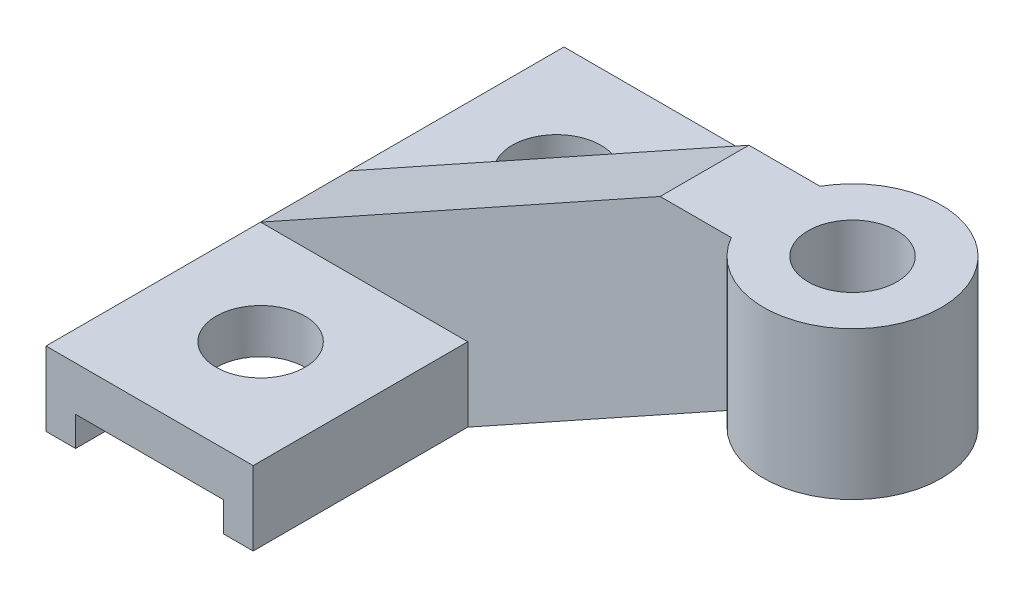
ISO-10303-21;
HEADER;
FILE_DESCRIPTION(('STEP AP214'),'2;1');
FILE_NAME('part.step','',(''),(''),'','','');
FILE_SCHEMA(('AUTOMOTIVE_DESIGN { 1 0 10303 214 1 1 1 1 }'));
ENDSEC;
DATA;
#1=APPLICATION_CONTEXT('core data for automotive mechanical design processes');
#2=APPLICATION_PROTOCOL_DEFINITION('international standard','automotive_design',2000,#1);
#3=PRODUCT_CONTEXT('',#1,'mechanical');
#4=PRODUCT('Part','Part','',(#3));
#5=PRODUCT_RELATED_PRODUCT_CATEGORY('part','',(#4));
#6=PRODUCT_DEFINITION_FORMATION('','',#4);
#7=PRODUCT_DEFINITION_CONTEXT('part definition',#1,'design');
#8=PRODUCT_DEFINITION('design','',#6,#7);
#9=PRODUCT_DEFINITION_SHAPE('','',#8);
#10=(LENGTH_UNIT() NAMED_UNIT(*) SI_UNIT(.MILLI.,.METRE.));
#11=(NAMED_UNIT(*) PLANE_ANGLE_UNIT() SI_UNIT($,.RADIAN.));
#12=(NAMED_UNIT(*) SI_UNIT($,.STERADIAN.) SOLID_ANGLE_UNIT());
#13=UNCERTAINTY_MEASURE_WITH_UNIT(LENGTH_MEASURE(1.E-05),#10,'distance_accuracy_value','');
#14=(GEOMETRIC_REPRESENTATION_CONTEXT(3) GLOBAL_UNCERTAINTY_ASSIGNED_CONTEXT((#13)) GLOBAL_UNIT_ASSIGNED_CONTEXT((#10,
#11,#12)) REPRESENTATION_CONTEXT('',''));
#15=CARTESIAN_POINT('',(0.,0.,0.));
#16=DIRECTION('',(0.,0.,1.));
#17=DIRECTION('',(1.,0.,0.));
#18=AXIS2_PLACEMENT_3D('',#15,#16,#17);
#19=CARTESIAN_POINT('',(0.,0.,3.));
#20=DIRECTION('',(0.,0.,-1.));
#21=DIRECTION('',(-1.,0.,0.));
#22=AXIS2_PLACEMENT_3D('',#19,#20,#21);
#23=PLANE('',#22);
#24=DIRECTION('',(1.,0.,0.));
#25=VECTOR('',#24,1.);
#26=CARTESIAN_POINT('',(0.,5.,3.));
#27=LINE('',#26,#25);
#28=CARTESIAN_POINT('',(24.8038475772934,5.,3.));
#29=VERTEX_POINT('',#28);
#30=CARTESIAN_POINT('',(25.,5.,3.));
#31=VERTEX_POINT('',#30);
#32=EDGE_CURVE('E282',#29,#31,#27,.T.);
#33=ORIENTED_EDGE('',*,*,#32,.F.);
#34=DIRECTION('',(0.,-1.,0.));
#35=VECTOR('',#34,1.);
#36=CARTESIAN_POINT('',(24.8038475772934,15.,3.));
#37=LINE('',#36,#35);
#38=CARTESIAN_POINT('',(24.8038475772934,15.,3.));
#39=VERTEX_POINT('',#38);
#40=EDGE_CURVE('E156',#39,#29,#37,.T.);
#41=ORIENTED_EDGE('',*,*,#40,.F.);
#42=DIRECTION('',(-1.,0.,0.));
#43=VECTOR('',#42,1.);
#44=CARTESIAN_POINT('',(20.,15.,3.));
#45=LINE('',#44,#43);
#46=CARTESIAN_POINT('',(20.,15.,3.));
#47=VERTEX_POINT('',#46);
#48=EDGE_CURVE('E155',#39,#47,#45,.T.);
#49=ORIENTED_EDGE('',*,*,#48,.T.);
#50=DIRECTION('',(-0.874157276121538,-0.485642931178632,0.));
#51=VECTOR('',#50,1.);
#52=CARTESIAN_POINT('',(-7.,0.,3.));
#53=LINE('',#52,#51);
#54=CARTESIAN_POINT('',(-7.,0.,3.));
#55=VERTEX_POINT('',#54);
#56=EDGE_CURVE('E173',#47,#55,#53,.T.);
#57=ORIENTED_EDGE('',*,*,#56,.T.);
#58=DIRECTION('',(1.,0.,0.));
#59=VECTOR('',#58,1.);
#60=CARTESIAN_POINT('',(-7.,0.,3.));
#61=LINE('',#60,#59);
#62=CARTESIAN_POINT('',(7.,0.,3.));
#63=VERTEX_POINT('',#62);
#64=EDGE_CURVE('E163',#55,#63,#61,.T.);
#65=ORIENTED_EDGE('',*,*,#64,.T.);
#66=DIRECTION('',(0.,-1.,0.));
#67=VECTOR('',#66,1.);
#68=CARTESIAN_POINT('',(7.,0.,3.));
#69=LINE('',#68,#67);
#70=CARTESIAN_POINT('',(7.,-5.,3.));
#71=VERTEX_POINT('',#70);
#72=EDGE_CURVE('E277',#63,#71,#69,.T.);
#73=ORIENTED_EDGE('',*,*,#72,.T.);
#74=DIRECTION('',(0.874157276121538,0.485642931178632,0.));
#75=VECTOR('',#74,1.);
#76=CARTESIAN_POINT('',(25.,5.,3.));
#77=LINE('',#76,#75);
#78=EDGE_CURVE('E279',#71,#31,#77,.T.);
#79=ORIENTED_EDGE('',*,*,#78,.T.);
#80=EDGE_LOOP('',(#33,#41,#49,#57,#65,#73,#79));
#81=FACE_BOUND('',#80,.T.);
#82=ADVANCED_FACE('F33',(#81),#23,.F.);
#83=CARTESIAN_POINT('',(0.,0.,-3.));
#84=DIRECTION('',(0.,0.,-1.));
#85=DIRECTION('',(-1.,0.,0.));
#86=AXIS2_PLACEMENT_3D('',#83,#84,#85);
#87=PLANE('',#86);
#88=DIRECTION('',(0.,-1.,0.));
#89=VECTOR('',#88,1.);
#90=CARTESIAN_POINT('',(24.8038475772934,15.,-3.));
#91=LINE('',#90,#89);
#92=CARTESIAN_POINT('',(24.8038475772934,15.,-3.));
#93=VERTEX_POINT('',#92);
#94=CARTESIAN_POINT('',(24.8038475772934,5.,-3.));
#95=VERTEX_POINT('',#94);
#96=EDGE_CURVE('E42',#93,#95,#91,.T.);
#97=ORIENTED_EDGE('',*,*,#96,.T.);
#98=DIRECTION('',(1.,0.,0.));
#99=VECTOR('',#98,1.);
#100=CARTESIAN_POINT('',(0.,5.,-3.));
#101=LINE('',#100,#99);
#102=CARTESIAN_POINT('',(25.,5.,-3.));
#103=VERTEX_POINT('',#102);
#104=EDGE_CURVE('E11',#95,#103,#101,.T.);
#105=ORIENTED_EDGE('',*,*,#104,.T.);
#106=DIRECTION('',(0.874157276121538,0.485642931178632,0.));
#107=VECTOR('',#106,1.);
#108=CARTESIAN_POINT('',(25.,5.,-3.));
#109=LINE('',#108,#107);
#110=CARTESIAN_POINT('',(7.,-5.,-3.));
#111=VERTEX_POINT('',#110);
#112=EDGE_CURVE('E161',#111,#103,#109,.T.);
#113=ORIENTED_EDGE('',*,*,#112,.F.);
#114=DIRECTION('',(0.,-1.,0.));
#115=VECTOR('',#114,1.);
#116=CARTESIAN_POINT('',(7.,0.,-3.));
#117=LINE('',#116,#115);
#118=CARTESIAN_POINT('',(7.,0.,-3.));
#119=VERTEX_POINT('',#118);
#120=EDGE_CURVE('E57',#119,#111,#117,.T.);
#121=ORIENTED_EDGE('',*,*,#120,.F.);
#122=DIRECTION('',(1.,0.,0.));
#123=VECTOR('',#122,1.);
#124=CARTESIAN_POINT('',(-7.,0.,-3.));
#125=LINE('',#124,#123);
#126=CARTESIAN_POINT('',(-7.,0.,-3.));
#127=VERTEX_POINT('',#126);
#128=EDGE_CURVE('E289',#127,#119,#125,.T.);
#129=ORIENTED_EDGE('',*,*,#128,.F.);
#130=DIRECTION('',(-0.874157276121538,-0.485642931178632,0.));
#131=VECTOR('',#130,1.);
#132=CARTESIAN_POINT('',(-7.,0.,-3.));
#133=LINE('',#132,#131);
#134=CARTESIAN_POINT('',(20.,15.,-3.));
#135=VERTEX_POINT('',#134);
#136=EDGE_CURVE('E160',#135,#127,#133,.T.);
#137=ORIENTED_EDGE('',*,*,#136,.F.);
#138=DIRECTION('',(-1.,0.,0.));
#139=VECTOR('',#138,1.);
#140=CARTESIAN_POINT('',(20.,15.,-3.));
#141=LINE('',#140,#139);
#142=EDGE_CURVE('E153',#93,#135,#141,.T.);
#143=ORIENTED_EDGE('',*,*,#142,.F.);
#144=EDGE_LOOP('',(#97,#105,#113,#121,#129,#137,#143));
#145=FACE_BOUND('',#144,.T.);
#146=ADVANCED_FACE('F159',(#145),#87,.T.);
#147=CARTESIAN_POINT('',(7.,0.,17.5));
#148=DIRECTION('',(-1.,0.,0.));
#149=DIRECTION('',(0.,0.,1.));
#150=AXIS2_PLACEMENT_3D('',#147,#148,#149);
#151=PLANE('',#150);
#152=ORIENTED_EDGE('',*,*,#72,.F.);
#153=DIRECTION('',(0.,0.,-1.));
#154=VECTOR('',#153,1.);
#155=CARTESIAN_POINT('',(7.,0.,17.5));
#156=LINE('',#155,#154);
#157=CARTESIAN_POINT('',(7.,0.,17.5));
#158=VERTEX_POINT('',#157);
#159=EDGE_CURVE('E221',#158,#63,#156,.T.);
#160=ORIENTED_EDGE('',*,*,#159,.F.);
#161=DIRECTION('',(0.,1.,0.));
#162=VECTOR('',#161,1.);
#163=CARTESIAN_POINT('',(7.,0.,17.5));
#164=LINE('',#163,#162);
#165=CARTESIAN_POINT('',(7.,-5.,17.5));
#166=VERTEX_POINT('',#165);
#167=EDGE_CURVE('E194',#166,#158,#164,.T.);
#168=ORIENTED_EDGE('',*,*,#167,.F.);
#169=DIRECTION('',(0.,0.,-1.));
#170=VECTOR('',#169,1.);
#171=CARTESIAN_POINT('',(7.,-5.,17.5));
#172=LINE('',#171,#170);
#173=EDGE_CURVE('E225',#166,#71,#172,.T.);
#174=ORIENTED_EDGE('',*,*,#173,.T.);
#175=EDGE_LOOP('',(#152,#160,#168,#174));
#176=FACE_BOUND('',#175,.T.);
#177=ADVANCED_FACE('F304',(#176),#151,.F.);
#178=CARTESIAN_POINT('',(-7.,0.,17.5));
#179=DIRECTION('',(0.,-1.,0.));
#180=DIRECTION('',(1.,0.,0.));
#181=AXIS2_PLACEMENT_3D('',#178,#179,#180);
#182=PLANE('',#181);
#183=CARTESIAN_POINT('',(0.,0.,10.));
#184=DIRECTION('',(0.,1.,0.));
#185=DIRECTION('',(-1.,0.,0.));
#186=AXIS2_PLACEMENT_3D('',#183,#184,#185);
#187=CIRCLE('',#186,3.);
#188=CARTESIAN_POINT('',(-3.,0.,10.));
#189=VERTEX_POINT('',#188);
#190=EDGE_CURVE('E323',#189,#189,#187,.T.);
#191=ORIENTED_EDGE('',*,*,#190,.F.);
#192=EDGE_LOOP('',(#191));
#193=FACE_BOUND('',#192,.T.);
#194=ORIENTED_EDGE('',*,*,#64,.F.);
#195=DIRECTION('',(0.,0.,-1.));
#196=VECTOR('',#195,1.);
#197=CARTESIAN_POINT('',(-7.,0.,17.5));
#198=LINE('',#197,#196);
#199=CARTESIAN_POINT('',(-7.,0.,17.5));
#200=VERTEX_POINT('',#199);
#201=EDGE_CURVE('E217',#200,#55,#198,.T.);
#202=ORIENTED_EDGE('',*,*,#201,.F.);
#203=DIRECTION('',(-1.,0.,0.));
#204=VECTOR('',#203,1.);
#205=CARTESIAN_POINT('',(-7.,0.,17.5));
#206=LINE('',#205,#204);
#207=EDGE_CURVE('E196',#158,#200,#206,.T.);
#208=ORIENTED_EDGE('',*,*,#207,.F.);
#209=ORIENTED_EDGE('',*,*,#159,.T.);
#210=EDGE_LOOP('',(#194,#202,#208,#209));
#211=FACE_BOUND('',#210,.T.);
#212=ADVANCED_FACE('F273',(#193,#211),#182,.F.);
#213=CARTESIAN_POINT('',(-7.,-5.,17.5));
#214=DIRECTION('',(1.,0.,0.));
#215=DIRECTION('',(0.,1.,0.));
#216=AXIS2_PLACEMENT_3D('',#213,#214,#215);
#217=PLANE('',#216);
#218=DIRECTION('',(0.,-1.,0.));
#219=VECTOR('',#218,1.);
#220=CARTESIAN_POINT('',(-7.,-5.,-17.5));
#221=LINE('',#220,#219);
#222=CARTESIAN_POINT('',(-7.,0.,-17.5));
#223=VERTEX_POINT('',#222);
#224=CARTESIAN_POINT('',(-7.,-5.,-17.5));
#225=VERTEX_POINT('',#224);
#226=EDGE_CURVE('E179',#223,#225,#221,.T.);
#227=ORIENTED_EDGE('',*,*,#226,.T.);
#228=DIRECTION('',(0.,0.,-1.));
#229=VECTOR('',#228,1.);
#230=CARTESIAN_POINT('',(-7.,-5.,17.5));
#231=LINE('',#230,#229);
#232=CARTESIAN_POINT('',(-7.,-5.,17.5));
#233=VERTEX_POINT('',#232);
#234=EDGE_CURVE('E146',#233,#225,#231,.T.);
#235=ORIENTED_EDGE('',*,*,#234,.F.);
#236=DIRECTION('',(0.,-1.,0.));
#237=VECTOR('',#236,1.);
#238=CARTESIAN_POINT('',(-7.,-5.,17.5));
#239=LINE('',#238,#237);
#240=EDGE_CURVE('E180',#200,#233,#239,.T.);
#241=ORIENTED_EDGE('',*,*,#240,.F.);
#242=ORIENTED_EDGE('',*,*,#201,.T.);
#243=DIRECTION('',(0.,0.,-1.));
#244=VECTOR('',#243,1.);
#245=CARTESIAN_POINT('',(-7.,0.,3.));
#246=LINE('',#245,#244);
#247=EDGE_CURVE('E169',#55,#127,#246,.T.);
#248=ORIENTED_EDGE('',*,*,#247,.T.);
#249=EDGE_CURVE('E198',#127,#223,#198,.T.);
#250=ORIENTED_EDGE('',*,*,#249,.T.);
#251=EDGE_LOOP('',(#227,#235,#241,#242,#248,#250));
#252=FACE_BOUND('',#251,.T.);
#253=ADVANCED_FACE('F35',(#252),#217,.F.);
#254=CARTESIAN_POINT('',(-5.,-5.,17.5));
#255=DIRECTION('',(0.,1.,0.));
#256=DIRECTION('',(-1.,0.,0.));
#257=AXIS2_PLACEMENT_3D('',#254,#255,#256);
#258=PLANE('',#257);
#259=DIRECTION('',(1.,0.,0.));
#260=VECTOR('',#259,1.);
#261=CARTESIAN_POINT('',(-5.,-5.,-17.5));
#262=LINE('',#261,#260);
#263=CARTESIAN_POINT('',(-5.,-5.,-17.5));
#264=VERTEX_POINT('',#263);
#265=EDGE_CURVE('E201',#225,#264,#262,.T.);
#266=ORIENTED_EDGE('',*,*,#265,.T.);
#267=DIRECTION('',(0.,0.,-1.));
#268=VECTOR('',#267,1.);
#269=CARTESIAN_POINT('',(-5.,-5.,17.5));
#270=LINE('',#269,#268);
#271=CARTESIAN_POINT('',(-5.,-5.,17.5));
#272=VERTEX_POINT('',#271);
#273=EDGE_CURVE('E237',#272,#264,#270,.T.);
#274=ORIENTED_EDGE('',*,*,#273,.F.);
#275=DIRECTION('',(1.,0.,0.));
#276=VECTOR('',#275,1.);
#277=CARTESIAN_POINT('',(-5.,-5.,17.5));
#278=LINE('',#277,#276);
#279=EDGE_CURVE('E183',#233,#272,#278,.T.);
#280=ORIENTED_EDGE('',*,*,#279,.F.);
#281=ORIENTED_EDGE('',*,*,#234,.T.);
#282=EDGE_LOOP('',(#266,#274,#280,#281));
#283=FACE_BOUND('',#282,.T.);
#284=ADVANCED_FACE('F243',(#283),#258,.F.);
#285=CARTESIAN_POINT('',(-5.,-3.,17.5));
#286=DIRECTION('',(-1.,0.,0.));
#287=DIRECTION('',(0.,0.,1.));
#288=AXIS2_PLACEMENT_3D('',#285,#286,#287);
#289=PLANE('',#288);
#290=DIRECTION('',(0.,1.,0.));
#291=VECTOR('',#290,1.);
#292=CARTESIAN_POINT('',(-5.,-3.,-17.5));
#293=LINE('',#292,#291);
#294=CARTESIAN_POINT('',(-5.,-3.,-17.5));
#295=VERTEX_POINT('',#294);
#296=EDGE_CURVE('E203',#264,#295,#293,.T.);
#297=ORIENTED_EDGE('',*,*,#296,.T.);
#298=DIRECTION('',(0.,0.,-1.));
#299=VECTOR('',#298,1.);
#300=CARTESIAN_POINT('',(-5.,-3.,17.5));
#301=LINE('',#300,#299);
#302=CARTESIAN_POINT('',(-5.,-3.,17.5));
#303=VERTEX_POINT('',#302);
#304=EDGE_CURVE('E234',#303,#295,#301,.T.);
#305=ORIENTED_EDGE('',*,*,#304,.F.);
#306=DIRECTION('',(0.,1.,0.));
#307=VECTOR('',#306,1.);
#308=CARTESIAN_POINT('',(-5.,-3.,17.5));
#309=LINE('',#308,#307);
#310=EDGE_CURVE('E186',#272,#303,#309,.T.);
#311=ORIENTED_EDGE('',*,*,#310,.F.);
#312=ORIENTED_EDGE('',*,*,#273,.T.);
#313=EDGE_LOOP('',(#297,#305,#311,#312));
#314=FACE_BOUND('',#313,.T.);
#315=ADVANCED_FACE('F258',(#314),#289,.F.);
#316=CARTESIAN_POINT('',(5.,-3.,17.5));
#317=DIRECTION('',(0.,1.,0.));
#318=DIRECTION('',(0.,0.,1.));
#319=AXIS2_PLACEMENT_3D('',#316,#317,#318);
#320=PLANE('',#319);
#321=CARTESIAN_POINT('',(0.,-3.,10.));
#322=DIRECTION('',(0.,1.,0.));
#323=DIRECTION('',(0.,0.,1.));
#324=AXIS2_PLACEMENT_3D('',#321,#322,#323);
#325=CIRCLE('',#324,3.);
#326=CARTESIAN_POINT('',(0.,-3.,13.));
#327=VERTEX_POINT('',#326);
#328=EDGE_CURVE('E37',#327,#327,#325,.T.);
#329=ORIENTED_EDGE('',*,*,#328,.T.);
#330=EDGE_LOOP('',(#329));
#331=FACE_BOUND('',#330,.T.);
#332=CARTESIAN_POINT('',(0.,-3.,-10.));
#333=DIRECTION('',(0.,1.,0.));
#334=DIRECTION('',(0.,0.,1.));
#335=AXIS2_PLACEMENT_3D('',#332,#333,#334);
#336=CIRCLE('',#335,3.);
#337=CARTESIAN_POINT('',(0.,-3.,-7.));
#338=VERTEX_POINT('',#337);
#339=EDGE_CURVE('E320',#338,#338,#336,.T.);
#340=ORIENTED_EDGE('',*,*,#339,.T.);
#341=EDGE_LOOP('',(#340));
#342=FACE_BOUND('',#341,.T.);
#343=DIRECTION('',(1.,0.,0.));
#344=VECTOR('',#343,1.);
#345=CARTESIAN_POINT('',(5.,-3.,-17.5));
#346=LINE('',#345,#344);
#347=CARTESIAN_POINT('',(5.,-3.,-17.5));
#348=VERTEX_POINT('',#347);
#349=EDGE_CURVE('E205',#295,#348,#346,.T.);
#350=ORIENTED_EDGE('',*,*,#349,.T.);
#351=DIRECTION('',(0.,0.,-1.));
#352=VECTOR('',#351,1.);
#353=CARTESIAN_POINT('',(5.,-3.,17.5));
#354=LINE('',#353,#352);
#355=CARTESIAN_POINT('',(5.,-3.,17.5));
#356=VERTEX_POINT('',#355);
#357=EDGE_CURVE('E231',#356,#348,#354,.T.);
#358=ORIENTED_EDGE('',*,*,#357,.F.);
#359=DIRECTION('',(1.,0.,0.));
#360=VECTOR('',#359,1.);
#361=CARTESIAN_POINT('',(5.,-3.,17.5));
#362=LINE('',#361,#360);
#363=EDGE_CURVE('E188',#303,#356,#362,.T.);
#364=ORIENTED_EDGE('',*,*,#363,.F.);
#365=ORIENTED_EDGE('',*,*,#304,.T.);
#366=EDGE_LOOP('',(#350,#358,#364,#365));
#367=FACE_BOUND('',#366,.T.);
#368=ADVANCED_FACE('F262',(#331,#342,#367),#320,.F.);
#369=CARTESIAN_POINT('',(5.,-5.,17.5));
#370=DIRECTION('',(1.,0.,0.));
#371=DIRECTION('',(0.,0.,-1.));
#372=AXIS2_PLACEMENT_3D('',#369,#370,#371);
#373=PLANE('',#372);
#374=DIRECTION('',(0.,-1.,0.));
#375=VECTOR('',#374,1.);
#376=CARTESIAN_POINT('',(5.,-5.,-17.5));
#377=LINE('',#376,#375);
#378=CARTESIAN_POINT('',(5.,-5.,-17.5));
#379=VERTEX_POINT('',#378);
#380=EDGE_CURVE('E207',#348,#379,#377,.T.);
#381=ORIENTED_EDGE('',*,*,#380,.T.);
#382=DIRECTION('',(0.,0.,-1.));
#383=VECTOR('',#382,1.);
#384=CARTESIAN_POINT('',(5.,-5.,17.5));
#385=LINE('',#384,#383);
#386=CARTESIAN_POINT('',(5.,-5.,17.5));
#387=VERTEX_POINT('',#386);
#388=EDGE_CURVE('E228',#387,#379,#385,.T.);
#389=ORIENTED_EDGE('',*,*,#388,.F.);
#390=DIRECTION('',(0.,-1.,0.));
#391=VECTOR('',#390,1.);
#392=CARTESIAN_POINT('',(5.,-5.,17.5));
#393=LINE('',#392,#391);
#394=EDGE_CURVE('E190',#356,#387,#393,.T.);
#395=ORIENTED_EDGE('',*,*,#394,.F.);
#396=ORIENTED_EDGE('',*,*,#357,.T.);
#397=EDGE_LOOP('',(#381,#389,#395,#396));
#398=FACE_BOUND('',#397,.T.);
#399=ADVANCED_FACE('F301',(#398),#373,.F.);
#400=CARTESIAN_POINT('',(7.,-5.,17.5));
#401=DIRECTION('',(0.,1.,0.));
#402=DIRECTION('',(-1.,0.,0.));
#403=AXIS2_PLACEMENT_3D('',#400,#401,#402);
#404=PLANE('',#403);
#405=DIRECTION('',(1.,0.,0.));
#406=VECTOR('',#405,1.);
#407=CARTESIAN_POINT('',(7.,-5.,-17.5));
#408=LINE('',#407,#406);
#409=CARTESIAN_POINT('',(7.,-5.,-17.5));
#410=VERTEX_POINT('',#409);
#411=EDGE_CURVE('E209',#379,#410,#408,.T.);
#412=ORIENTED_EDGE('',*,*,#411,.T.);
#413=EDGE_CURVE('E224',#111,#410,#172,.T.);
#414=ORIENTED_EDGE('',*,*,#413,.F.);
#415=DIRECTION('',(0.,0.,-1.));
#416=VECTOR('',#415,1.);
#417=CARTESIAN_POINT('',(7.,-5.,3.));
#418=LINE('',#417,#416);
#419=EDGE_CURVE('E177',#71,#111,#418,.T.);
#420=ORIENTED_EDGE('',*,*,#419,.F.);
#421=ORIENTED_EDGE('',*,*,#173,.F.);
#422=DIRECTION('',(1.,0.,0.));
#423=VECTOR('',#422,1.);
#424=CARTESIAN_POINT('',(7.,-5.,17.5));
#425=LINE('',#424,#423);
#426=EDGE_CURVE('E192',#387,#166,#425,.T.);
#427=ORIENTED_EDGE('',*,*,#426,.F.);
#428=ORIENTED_EDGE('',*,*,#388,.T.);
#429=EDGE_LOOP('',(#412,#414,#420,#421,#427,#428));
#430=FACE_BOUND('',#429,.T.);
#431=ADVANCED_FACE('F296',(#430),#404,.F.);
#432=CARTESIAN_POINT('',(7.,0.,-17.5));
#433=VERTEX_POINT('',#432);
#434=EDGE_CURVE('E220',#119,#433,#156,.T.);
#435=ORIENTED_EDGE('',*,*,#434,.F.);
#436=ORIENTED_EDGE('',*,*,#120,.T.);
#437=ORIENTED_EDGE('',*,*,#413,.T.);
#438=DIRECTION('',(0.,1.,0.));
#439=VECTOR('',#438,1.);
#440=CARTESIAN_POINT('',(7.,0.,-17.5));
#441=LINE('',#440,#439);
#442=EDGE_CURVE('E212',#410,#433,#441,.T.);
#443=ORIENTED_EDGE('',*,*,#442,.T.);
#444=EDGE_LOOP('',(#435,#436,#437,#443));
#445=FACE_BOUND('',#444,.T.);
#446=ADVANCED_FACE('F293',(#445),#151,.F.);
#447=CARTESIAN_POINT('',(0.,0.,-10.));
#448=DIRECTION('',(0.,1.,0.));
#449=DIRECTION('',(1.,0.,0.));
#450=AXIS2_PLACEMENT_3D('',#447,#448,#449);
#451=CIRCLE('',#450,3.);
#452=CARTESIAN_POINT('',(3.,0.,-10.));
#453=VERTEX_POINT('',#452);
#454=EDGE_CURVE('E324',#453,#453,#451,.T.);
#455=ORIENTED_EDGE('',*,*,#454,.F.);
#456=EDGE_LOOP('',(#455));
#457=FACE_BOUND('',#456,.T.);
#458=ORIENTED_EDGE('',*,*,#249,.F.);
#459=ORIENTED_EDGE('',*,*,#128,.T.);
#460=ORIENTED_EDGE('',*,*,#434,.T.);
#461=DIRECTION('',(-1.,0.,0.));
#462=VECTOR('',#461,1.);
#463=CARTESIAN_POINT('',(-7.,0.,-17.5));
#464=LINE('',#463,#462);
#465=EDGE_CURVE('E184',#433,#223,#464,.T.);
#466=ORIENTED_EDGE('',*,*,#465,.T.);
#467=EDGE_LOOP('',(#458,#459,#460,#466));
#468=FACE_BOUND('',#467,.T.);
#469=ADVANCED_FACE('F335',(#457,#468),#182,.F.);
#470=CARTESIAN_POINT('',(0.,0.,17.5));
#471=DIRECTION('',(0.,0.,-1.));
#472=DIRECTION('',(-1.,0.,0.));
#473=AXIS2_PLACEMENT_3D('',#470,#471,#472);
#474=PLANE('',#473);
#475=ORIENTED_EDGE('',*,*,#240,.T.);
#476=ORIENTED_EDGE('',*,*,#279,.T.);
#477=ORIENTED_EDGE('',*,*,#310,.T.);
#478=ORIENTED_EDGE('',*,*,#363,.T.);
#479=ORIENTED_EDGE('',*,*,#394,.T.);
#480=ORIENTED_EDGE('',*,*,#426,.T.);
#481=ORIENTED_EDGE('',*,*,#167,.T.);
#482=ORIENTED_EDGE('',*,*,#207,.T.);
#483=EDGE_LOOP('',(#475,#476,#477,#478,#479,#480,#481,#482));
#484=FACE_BOUND('',#483,.T.);
#485=ADVANCED_FACE('F266',(#484),#474,.F.);
#486=CARTESIAN_POINT('',(0.,0.,-17.5));
#487=DIRECTION('',(0.,0.,-1.));
#488=DIRECTION('',(-1.,0.,0.));
#489=AXIS2_PLACEMENT_3D('',#486,#487,#488);
#490=PLANE('',#489);
#491=ORIENTED_EDGE('',*,*,#226,.F.);
#492=ORIENTED_EDGE('',*,*,#465,.F.);
#493=ORIENTED_EDGE('',*,*,#442,.F.);
#494=ORIENTED_EDGE('',*,*,#411,.F.);
#495=ORIENTED_EDGE('',*,*,#380,.F.);
#496=ORIENTED_EDGE('',*,*,#349,.F.);
#497=ORIENTED_EDGE('',*,*,#296,.F.);
#498=ORIENTED_EDGE('',*,*,#265,.F.);
#499=EDGE_LOOP('',(#491,#492,#493,#494,#495,#496,#497,#498));
#500=FACE_BOUND('',#499,.T.);
#501=ADVANCED_FACE('F251',(#500),#490,.T.);
#502=CARTESIAN_POINT('',(25.,5.,3.));
#503=DIRECTION('',(-0.485642931178632,0.874157276121538,0.));
#504=DIRECTION('',(-0.874157276121538,-0.485642931178632,0.));
#505=AXIS2_PLACEMENT_3D('',#502,#503,#504);
#506=PLANE('',#505);
#507=ORIENTED_EDGE('',*,*,#112,.T.);
#508=DIRECTION('',(0.,0.,-1.));
#509=VECTOR('',#508,1.);
#510=CARTESIAN_POINT('',(25.,5.,3.));
#511=LINE('',#510,#509);
#512=EDGE_CURVE('E175',#31,#103,#511,.T.);
#513=ORIENTED_EDGE('',*,*,#512,.F.);
#514=ORIENTED_EDGE('',*,*,#78,.F.);
#515=ORIENTED_EDGE('',*,*,#419,.T.);
#516=EDGE_LOOP('',(#507,#513,#514,#515));
#517=FACE_BOUND('',#516,.T.);
#518=ADVANCED_FACE('F309',(#517),#506,.F.);
#519=CARTESIAN_POINT('',(20.,15.,3.));
#520=DIRECTION('',(0.,-1.,0.));
#521=DIRECTION('',(1.,0.,0.));
#522=AXIS2_PLACEMENT_3D('',#519,#520,#521);
#523=PLANE('',#522);
#524=ORIENTED_EDGE('',*,*,#48,.F.);
#525=CARTESIAN_POINT('',(30.,15.,0.));
#526=DIRECTION('',(0.,1.,0.));
#527=DIRECTION('',(0.,0.,1.));
#528=AXIS2_PLACEMENT_3D('',#525,#526,#527);
#529=CIRCLE('',#528,6.);
#530=EDGE_CURVE('E143',#39,#93,#529,.T.);
#531=ORIENTED_EDGE('',*,*,#530,.T.);
#532=ORIENTED_EDGE('',*,*,#142,.T.);
#533=DIRECTION('',(0.,0.,-1.));
#534=VECTOR('',#533,1.);
#535=CARTESIAN_POINT('',(20.,15.,3.));
#536=LINE('',#535,#534);
#537=EDGE_CURVE('E172',#47,#135,#536,.T.);
#538=ORIENTED_EDGE('',*,*,#537,.F.);
#539=EDGE_LOOP('',(#524,#531,#532,#538));
#540=FACE_BOUND('',#539,.T.);
#541=CARTESIAN_POINT('',(30.,15.,0.));
#542=DIRECTION('',(0.,1.,0.));
#543=DIRECTION('',(0.,0.,1.));
#544=AXIS2_PLACEMENT_3D('',#541,#542,#543);
#545=CIRCLE('',#544,3.);
#546=CARTESIAN_POINT('',(30.,15.,3.));
#547=VERTEX_POINT('',#546);
#548=EDGE_CURVE('E313',#547,#547,#545,.T.);
#549=ORIENTED_EDGE('',*,*,#548,.F.);
#550=EDGE_LOOP('',(#549));
#551=FACE_BOUND('',#550,.T.);
#552=ADVANCED_FACE('F150',(#540,#551),#523,.F.);
#553=CARTESIAN_POINT('',(-7.,0.,3.));
#554=DIRECTION('',(0.485642931178632,-0.874157276121538,0.));
#555=DIRECTION('',(0.874157276121538,0.485642931178632,0.));
#556=AXIS2_PLACEMENT_3D('',#553,#554,#555);
#557=PLANE('',#556);
#558=ORIENTED_EDGE('',*,*,#136,.T.);
#559=ORIENTED_EDGE('',*,*,#247,.F.);
#560=ORIENTED_EDGE('',*,*,#56,.F.);
#561=ORIENTED_EDGE('',*,*,#537,.T.);
#562=EDGE_LOOP('',(#558,#559,#560,#561));
#563=FACE_BOUND('',#562,.T.);
#564=ADVANCED_FACE('F353',(#563),#557,.F.);
#565=CARTESIAN_POINT('',(30.,5.,0.));
#566=DIRECTION('',(0.,1.,0.));
#567=DIRECTION('',(0.,0.,1.));
#568=AXIS2_PLACEMENT_3D('',#565,#566,#567);
#569=PLANE('',#568);
#570=CARTESIAN_POINT('',(30.,5.,0.));
#571=DIRECTION('',(0.,1.,0.));
#572=DIRECTION('',(0.,0.,1.));
#573=AXIS2_PLACEMENT_3D('',#570,#571,#572);
#574=CIRCLE('',#573,3.);
#575=CARTESIAN_POINT('',(30.,5.,3.));
#576=VERTEX_POINT('',#575);
#577=EDGE_CURVE('E315',#576,#576,#574,.T.);
#578=ORIENTED_EDGE('',*,*,#577,.T.);
#579=EDGE_LOOP('',(#578));
#580=FACE_BOUND('',#579,.T.);
#581=CARTESIAN_POINT('',(30.,5.,0.));
#582=DIRECTION('',(0.,1.,0.));
#583=DIRECTION('',(0.,0.,1.));
#584=AXIS2_PLACEMENT_3D('',#581,#582,#583);
#585=CIRCLE('',#584,6.);
#586=EDGE_CURVE('E49',#29,#95,#585,.T.);
#587=ORIENTED_EDGE('',*,*,#586,.F.);
#588=ORIENTED_EDGE('',*,*,#32,.T.);
#589=ORIENTED_EDGE('',*,*,#512,.T.);
#590=ORIENTED_EDGE('',*,*,#104,.F.);
#591=EDGE_LOOP('',(#587,#588,#589,#590));
#592=FACE_BOUND('',#591,.T.);
#593=ADVANCED_FACE('F311',(#580,#592),#569,.F.);
#594=CARTESIAN_POINT('',(30.,15.,0.));
#595=DIRECTION('',(0.,-1.,0.));
#596=DIRECTION('',(0.,0.,-1.));
#597=AXIS2_PLACEMENT_3D('',#594,#595,#596);
#598=CYLINDRICAL_SURFACE('',#597,6.);
#599=ORIENTED_EDGE('',*,*,#530,.F.);
#600=ORIENTED_EDGE('',*,*,#40,.T.);
#601=ORIENTED_EDGE('',*,*,#586,.T.);
#602=ORIENTED_EDGE('',*,*,#96,.F.);
#603=EDGE_LOOP('',(#599,#600,#601,#602));
#604=FACE_BOUND('',#603,.T.);
#605=ADVANCED_FACE('F142',(#604),#598,.T.);
#606=CARTESIAN_POINT('',(30.,15.,0.));
#607=DIRECTION('',(0.,-1.,0.));
#608=DIRECTION('',(0.,0.,-1.));
#609=AXIS2_PLACEMENT_3D('',#606,#607,#608);
#610=CYLINDRICAL_SURFACE('',#609,3.);
#611=ORIENTED_EDGE('',*,*,#548,.T.);
#612=EDGE_LOOP('',(#611));
#613=FACE_BOUND('',#612,.T.);
#614=ORIENTED_EDGE('',*,*,#577,.F.);
#615=EDGE_LOOP('',(#614));
#616=FACE_BOUND('',#615,.T.);
#617=ADVANCED_FACE('F394',(#613,#616),#610,.F.);
#618=CARTESIAN_POINT('',(0.,-5.00000000000001,-10.));
#619=DIRECTION('',(0.,1.,0.));
#620=DIRECTION('',(-1.,0.,0.));
#621=AXIS2_PLACEMENT_3D('',#618,#619,#620);
#622=CYLINDRICAL_SURFACE('',#621,3.);
#623=ORIENTED_EDGE('',*,*,#454,.T.);
#624=EDGE_LOOP('',(#623));
#625=FACE_BOUND('',#624,.T.);
#626=ORIENTED_EDGE('',*,*,#339,.F.);
#627=EDGE_LOOP('',(#626));
#628=FACE_BOUND('',#627,.T.);
#629=ADVANCED_FACE('F400',(#625,#628),#622,.F.);
#630=CARTESIAN_POINT('',(0.,-5.00000000000001,10.));
#631=DIRECTION('',(0.,1.,0.));
#632=DIRECTION('',(-1.,0.,0.));
#633=AXIS2_PLACEMENT_3D('',#630,#631,#632);
#634=CYLINDRICAL_SURFACE('',#633,3.);
#635=ORIENTED_EDGE('',*,*,#190,.T.);
#636=EDGE_LOOP('',(#635));
#637=FACE_BOUND('',#636,.T.);
#638=ORIENTED_EDGE('',*,*,#328,.F.);
#639=EDGE_LOOP('',(#638));
#640=FACE_BOUND('',#639,.T.);
#641=ADVANCED_FACE('F330',(#637,#640),#634,.F.);
#642=CLOSED_SHELL('',(#82,#146,#177,#212,#253,#284,#315,#368,#399,#431,#446,#469,#485,#501,#518,
#552,#564,#593,#605,#617,#629,#641));
#643=MANIFOLD_SOLID_BREP('B2',#642);
#644=ADVANCED_BREP_SHAPE_REPRESENTATION('',(#18,#643),#14);
#645=SHAPE_DEFINITION_REPRESENTATION(#9,#644);
ENDSEC;
END-ISO-10303-21;
